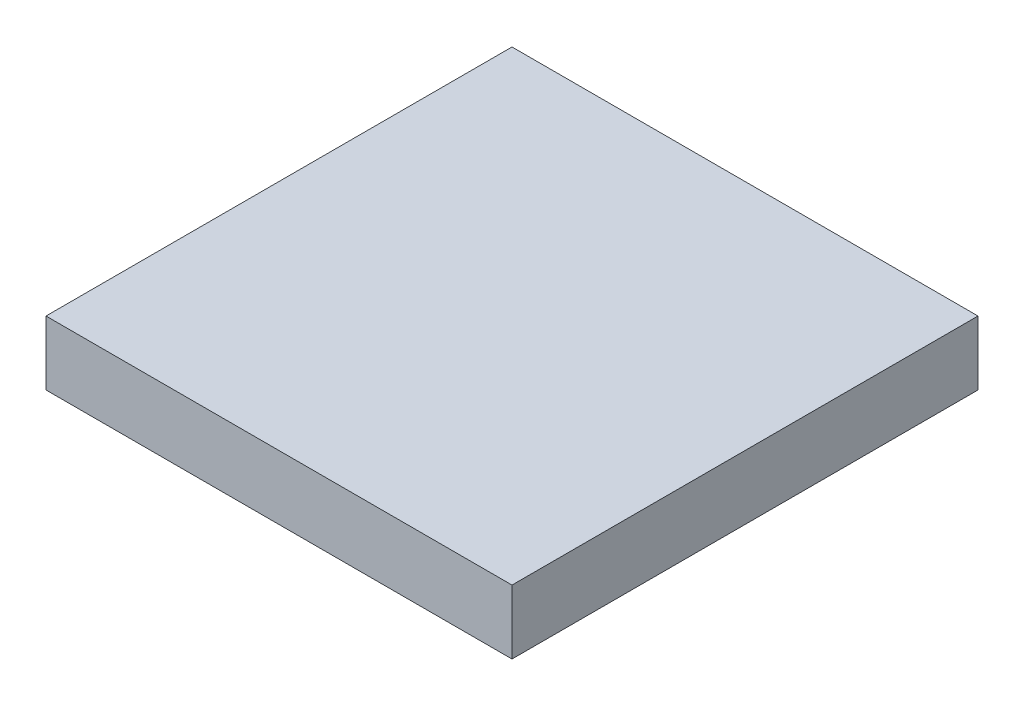
ISO-10303-21;
HEADER;
FILE_DESCRIPTION(('STEP AP214'),'2;1');
FILE_NAME('part.step','',(''),(''),'','','');
FILE_SCHEMA(('AUTOMOTIVE_DESIGN { 1 0 10303 214 1 1 1 1 }'));
ENDSEC;
DATA;
#1=APPLICATION_CONTEXT('core data for automotive mechanical design processes');
#2=APPLICATION_PROTOCOL_DEFINITION('international standard','automotive_design',2000,#1);
#3=PRODUCT_CONTEXT('',#1,'mechanical');
#4=PRODUCT('Part','Part','',(#3));
#5=PRODUCT_RELATED_PRODUCT_CATEGORY('part','',(#4));
#6=PRODUCT_DEFINITION_FORMATION('','',#4);
#7=PRODUCT_DEFINITION_CONTEXT('part definition',#1,'design');
#8=PRODUCT_DEFINITION('design','',#6,#7);
#9=PRODUCT_DEFINITION_SHAPE('','',#8);
#10=(LENGTH_UNIT() NAMED_UNIT(*) SI_UNIT(.MILLI.,.METRE.));
#11=(NAMED_UNIT(*) PLANE_ANGLE_UNIT() SI_UNIT($,.RADIAN.));
#12=(NAMED_UNIT(*) SI_UNIT($,.STERADIAN.) SOLID_ANGLE_UNIT());
#13=UNCERTAINTY_MEASURE_WITH_UNIT(LENGTH_MEASURE(1.E-05),#10,'distance_accuracy_value','');
#14=(GEOMETRIC_REPRESENTATION_CONTEXT(3) GLOBAL_UNCERTAINTY_ASSIGNED_CONTEXT((#13)) GLOBAL_UNIT_ASSIGNED_CONTEXT((#10,
#11,#12)) REPRESENTATION_CONTEXT('',''));
#15=CARTESIAN_POINT('',(0.,0.,0.));
#16=DIRECTION('',(0.,0.,1.));
#17=DIRECTION('',(1.,0.,0.));
#18=AXIS2_PLACEMENT_3D('',#15,#16,#17);
#19=CARTESIAN_POINT('',(0.,0.,0.));
#20=DIRECTION('',(0.,-1.,0.));
#21=DIRECTION('',(0.,0.,-1.));
#22=AXIS2_PLACEMENT_3D('',#19,#20,#21);
#23=PLANE('',#22);
#24=DIRECTION('',(0.,0.,-1.));
#25=VECTOR('',#24,1.);
#26=CARTESIAN_POINT('',(-2.,0.,2.));
#27=LINE('',#26,#25);
#28=CARTESIAN_POINT('',(-2.,0.,2.));
#29=VERTEX_POINT('',#28);
#30=CARTESIAN_POINT('',(-2.,0.,-2.));
#31=VERTEX_POINT('',#30);
#32=EDGE_CURVE('E52',#29,#31,#27,.T.);
#33=ORIENTED_EDGE('',*,*,#32,.T.);
#34=DIRECTION('',(1.,0.,0.));
#35=VECTOR('',#34,1.);
#36=CARTESIAN_POINT('',(-2.,0.,-2.));
#37=LINE('',#36,#35);
#38=CARTESIAN_POINT('',(2.,0.,-2.));
#39=VERTEX_POINT('',#38);
#40=EDGE_CURVE('E73',#31,#39,#37,.T.);
#41=ORIENTED_EDGE('',*,*,#40,.T.);
#42=DIRECTION('',(0.,0.,1.));
#43=VECTOR('',#42,1.);
#44=CARTESIAN_POINT('',(2.,0.,2.));
#45=LINE('',#44,#43);
#46=CARTESIAN_POINT('',(2.,0.,2.));
#47=VERTEX_POINT('',#46);
#48=EDGE_CURVE('E55',#39,#47,#45,.T.);
#49=ORIENTED_EDGE('',*,*,#48,.T.);
#50=DIRECTION('',(-1.,0.,0.));
#51=VECTOR('',#50,1.);
#52=CARTESIAN_POINT('',(-2.,0.,2.));
#53=LINE('',#52,#51);
#54=EDGE_CURVE('E17',#47,#29,#53,.T.);
#55=ORIENTED_EDGE('',*,*,#54,.T.);
#56=EDGE_LOOP('',(#33,#41,#49,#55));
#57=FACE_BOUND('',#56,.T.);
#58=ADVANCED_FACE('F14',(#57),#23,.T.);
#59=CARTESIAN_POINT('',(-2.,0.55,2.));
#60=DIRECTION('',(0.,0.,-1.));
#61=DIRECTION('',(-1.,0.,0.));
#62=AXIS2_PLACEMENT_3D('',#59,#60,#61);
#63=PLANE('',#62);
#64=DIRECTION('',(0.,1.,0.));
#65=VECTOR('',#64,1.);
#66=CARTESIAN_POINT('',(2.,0.55,2.));
#67=LINE('',#66,#65);
#68=CARTESIAN_POINT('',(2.,0.55,2.));
#69=VERTEX_POINT('',#68);
#70=EDGE_CURVE('E75',#47,#69,#67,.T.);
#71=ORIENTED_EDGE('',*,*,#70,.T.);
#72=DIRECTION('',(1.,0.,0.));
#73=VECTOR('',#72,1.);
#74=CARTESIAN_POINT('',(0.,0.55,2.));
#75=LINE('',#74,#73);
#76=CARTESIAN_POINT('',(-2.,0.55,2.));
#77=VERTEX_POINT('',#76);
#78=EDGE_CURVE('E70',#69,#77,#75,.F.);
#79=ORIENTED_EDGE('',*,*,#78,.T.);
#80=DIRECTION('',(0.,1.,0.));
#81=VECTOR('',#80,1.);
#82=CARTESIAN_POINT('',(-2.,0.55,2.));
#83=LINE('',#82,#81);
#84=EDGE_CURVE('E60',#77,#29,#83,.F.);
#85=ORIENTED_EDGE('',*,*,#84,.T.);
#86=ORIENTED_EDGE('',*,*,#54,.F.);
#87=EDGE_LOOP('',(#71,#79,#85,#86));
#88=FACE_BOUND('',#87,.T.);
#89=ADVANCED_FACE('F69',(#88),#63,.F.);
#90=CARTESIAN_POINT('',(-2.,0.55,2.));
#91=DIRECTION('',(1.,0.,0.));
#92=DIRECTION('',(0.,0.,-1.));
#93=AXIS2_PLACEMENT_3D('',#90,#91,#92);
#94=PLANE('',#93);
#95=ORIENTED_EDGE('',*,*,#84,.F.);
#96=DIRECTION('',(0.,0.,-1.));
#97=VECTOR('',#96,1.);
#98=CARTESIAN_POINT('',(-2.,0.55,0.));
#99=LINE('',#98,#97);
#100=CARTESIAN_POINT('',(-2.,0.55,-2.));
#101=VERTEX_POINT('',#100);
#102=EDGE_CURVE('E80',#77,#101,#99,.T.);
#103=ORIENTED_EDGE('',*,*,#102,.T.);
#104=DIRECTION('',(0.,1.,0.));
#105=VECTOR('',#104,1.);
#106=CARTESIAN_POINT('',(-2.,0.55,-2.));
#107=LINE('',#106,#105);
#108=EDGE_CURVE('E66',#101,#31,#107,.F.);
#109=ORIENTED_EDGE('',*,*,#108,.T.);
#110=ORIENTED_EDGE('',*,*,#32,.F.);
#111=EDGE_LOOP('',(#95,#103,#109,#110));
#112=FACE_BOUND('',#111,.T.);
#113=ADVANCED_FACE('F63',(#112),#94,.F.);
#114=CARTESIAN_POINT('',(-2.,0.55,-2.));
#115=DIRECTION('',(0.,0.,1.));
#116=DIRECTION('',(1.,0.,0.));
#117=AXIS2_PLACEMENT_3D('',#114,#115,#116);
#118=PLANE('',#117);
#119=ORIENTED_EDGE('',*,*,#108,.F.);
#120=DIRECTION('',(1.,0.,0.));
#121=VECTOR('',#120,1.);
#122=CARTESIAN_POINT('',(0.,0.55,-2.));
#123=LINE('',#122,#121);
#124=CARTESIAN_POINT('',(2.,0.55,-2.));
#125=VERTEX_POINT('',#124);
#126=EDGE_CURVE('E23',#101,#125,#123,.T.);
#127=ORIENTED_EDGE('',*,*,#126,.T.);
#128=DIRECTION('',(0.,1.,0.));
#129=VECTOR('',#128,1.);
#130=CARTESIAN_POINT('',(2.,0.55,-2.));
#131=LINE('',#130,#129);
#132=EDGE_CURVE('E31',#125,#39,#131,.F.);
#133=ORIENTED_EDGE('',*,*,#132,.T.);
#134=ORIENTED_EDGE('',*,*,#40,.F.);
#135=EDGE_LOOP('',(#119,#127,#133,#134));
#136=FACE_BOUND('',#135,.T.);
#137=ADVANCED_FACE('F85',(#136),#118,.F.);
#138=CARTESIAN_POINT('',(2.,0.55,2.));
#139=DIRECTION('',(-1.,0.,0.));
#140=DIRECTION('',(0.,0.,1.));
#141=AXIS2_PLACEMENT_3D('',#138,#139,#140);
#142=PLANE('',#141);
#143=ORIENTED_EDGE('',*,*,#132,.F.);
#144=DIRECTION('',(0.,0.,-1.));
#145=VECTOR('',#144,1.);
#146=CARTESIAN_POINT('',(2.,0.55,0.));
#147=LINE('',#146,#145);
#148=EDGE_CURVE('E9',#125,#69,#147,.F.);
#149=ORIENTED_EDGE('',*,*,#148,.T.);
#150=ORIENTED_EDGE('',*,*,#70,.F.);
#151=ORIENTED_EDGE('',*,*,#48,.F.);
#152=EDGE_LOOP('',(#143,#149,#150,#151));
#153=FACE_BOUND('',#152,.T.);
#154=ADVANCED_FACE('F88',(#153),#142,.F.);
#155=CARTESIAN_POINT('',(0.,0.55,0.));
#156=DIRECTION('',(0.,-1.,0.));
#157=DIRECTION('',(0.,0.,-1.));
#158=AXIS2_PLACEMENT_3D('',#155,#156,#157);
#159=PLANE('',#158);
#160=ORIENTED_EDGE('',*,*,#126,.F.);
#161=ORIENTED_EDGE('',*,*,#102,.F.);
#162=ORIENTED_EDGE('',*,*,#78,.F.);
#163=ORIENTED_EDGE('',*,*,#148,.F.);
#164=EDGE_LOOP('',(#160,#161,#162,#163));
#165=FACE_BOUND('',#164,.T.);
#166=ADVANCED_FACE('F87',(#165),#159,.F.);
#167=CLOSED_SHELL('',(#58,#89,#113,#137,#154,#166));
#168=MANIFOLD_SOLID_BREP('B1',#167);
#169=ADVANCED_BREP_SHAPE_REPRESENTATION('',(#18,#168),#14);
#170=SHAPE_DEFINITION_REPRESENTATION(#9,#169);
ENDSEC;
END-ISO-10303-21;
